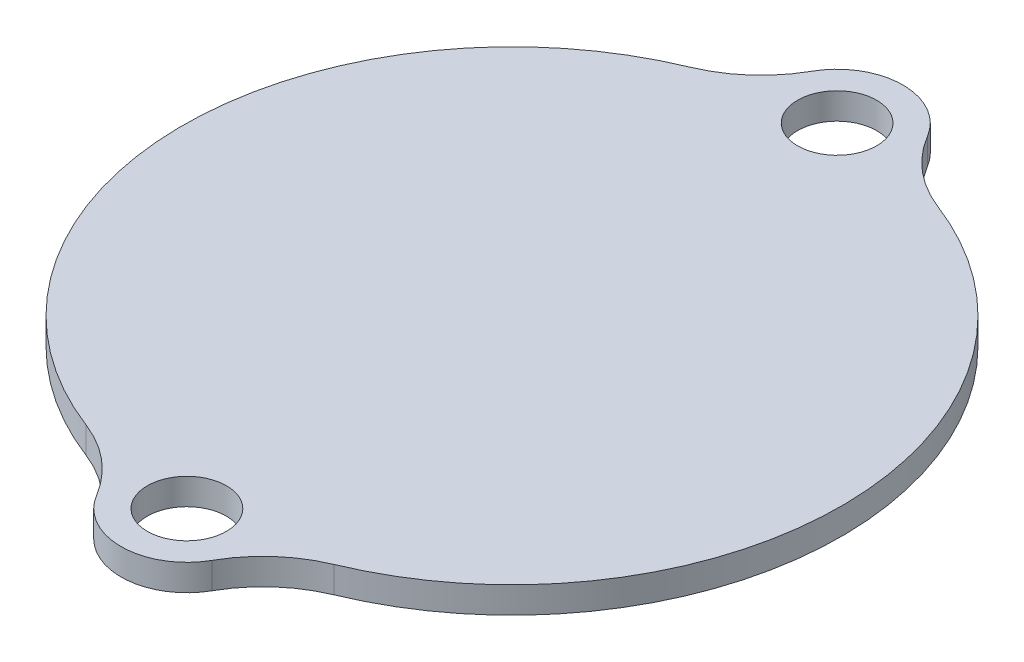
ISO-10303-21;
HEADER;
FILE_DESCRIPTION(('STEP AP214'),'2;1');
FILE_NAME('part.step','',(''),(''),'','','');
FILE_SCHEMA(('AUTOMOTIVE_DESIGN { 1 0 10303 214 1 1 1 1 }'));
ENDSEC;
DATA;
#1=APPLICATION_CONTEXT('core data for automotive mechanical design processes');
#2=APPLICATION_PROTOCOL_DEFINITION('international standard','automotive_design',2000,#1);
#3=PRODUCT_CONTEXT('',#1,'mechanical');
#4=PRODUCT('Part','Part','',(#3));
#5=PRODUCT_RELATED_PRODUCT_CATEGORY('part','',(#4));
#6=PRODUCT_DEFINITION_FORMATION('','',#4);
#7=PRODUCT_DEFINITION_CONTEXT('part definition',#1,'design');
#8=PRODUCT_DEFINITION('design','',#6,#7);
#9=PRODUCT_DEFINITION_SHAPE('','',#8);
#10=(LENGTH_UNIT() NAMED_UNIT(*) SI_UNIT(.MILLI.,.METRE.));
#11=(NAMED_UNIT(*) PLANE_ANGLE_UNIT() SI_UNIT($,.RADIAN.));
#12=(NAMED_UNIT(*) SI_UNIT($,.STERADIAN.) SOLID_ANGLE_UNIT());
#13=UNCERTAINTY_MEASURE_WITH_UNIT(LENGTH_MEASURE(1.E-05),#10,'distance_accuracy_value','');
#14=(GEOMETRIC_REPRESENTATION_CONTEXT(3) GLOBAL_UNCERTAINTY_ASSIGNED_CONTEXT((#13)) GLOBAL_UNIT_ASSIGNED_CONTEXT((#10,
#11,#12)) REPRESENTATION_CONTEXT('',''));
#15=CARTESIAN_POINT('',(0.,0.,0.));
#16=DIRECTION('',(0.,0.,1.));
#17=DIRECTION('',(1.,0.,0.));
#18=AXIS2_PLACEMENT_3D('',#15,#16,#17);
#19=CARTESIAN_POINT('',(-6.87723061472657,2.,-28.6610135737009));
#20=DIRECTION('',(0.,1.,0.));
#21=DIRECTION('',(0.,0.,1.));
#22=AXIS2_PLACEMENT_3D('',#19,#20,#21);
#23=PLANE('',#22);
#24=CARTESIAN_POINT('',(-0.332708957571853,2.,-24.9977859969548));
#25=DIRECTION('',(0.,1.,0.));
#26=DIRECTION('',(0.,0.,1.));
#27=AXIS2_PLACEMENT_3D('',#24,#25,#26);
#28=CIRCLE('',#27,3.);
#29=CARTESIAN_POINT('',(-0.332708957571853,2.,-21.9977859969548));
#30=VERTEX_POINT('',#29);
#31=EDGE_CURVE('E146',#30,#30,#28,.T.);
#32=ORIENTED_EDGE('',*,*,#31,.F.);
#33=EDGE_LOOP('',(#32));
#34=FACE_BOUND('',#33,.T.);
#35=CARTESIAN_POINT('',(-13.4217522718813,2.,-32.324241150447));
#36=DIRECTION('',(0.,-1.,0.));
#37=DIRECTION('',(0.,0.,1.));
#38=AXIS2_PLACEMENT_3D('',#35,#36,#37);
#39=CIRCLE('',#38,10.);
#40=CARTESIAN_POINT('',(-4.695723395675,2.,-27.4399377147855));
#41=VERTEX_POINT('',#40);
#42=CARTESIAN_POINT('',(-9.58696590848663,2.,-23.0887436788907));
#43=VERTEX_POINT('',#42);
#44=EDGE_CURVE('E164',#41,#43,#39,.T.);
#45=ORIENTED_EDGE('',*,*,#44,.T.);
#46=CARTESIAN_POINT('',(0.,2.,0.));
#47=DIRECTION('',(0.,1.,0.));
#48=DIRECTION('',(0.,0.,1.));
#49=AXIS2_PLACEMENT_3D('',#46,#47,#48);
#50=CIRCLE('',#49,25.);
#51=CARTESIAN_POINT('',(-8.96907784442479,2.,23.3357160297397));
#52=VERTEX_POINT('',#51);
#53=EDGE_CURVE('E100',#43,#52,#50,.T.);
#54=ORIENTED_EDGE('',*,*,#53,.T.);
#55=CARTESIAN_POINT('',(-12.5567089821947,2.,32.6700024416355));
#56=DIRECTION('',(0.,-1.,0.));
#57=DIRECTION('',(0.,0.,-1.));
#58=AXIS2_PLACEMENT_3D('',#55,#56,#57);
#59=CIRCLE('',#58,10.);
#60=CARTESIAN_POINT('',(-3.96376368901712,2.,27.5551914785151));
#61=VERTEX_POINT('',#60);
#62=EDGE_CURVE('E185',#52,#61,#59,.T.);
#63=ORIENTED_EDGE('',*,*,#62,.T.);
#64=CARTESIAN_POINT('',(0.332708957571678,2.,24.9977859969548));
#65=DIRECTION('',(0.,1.,0.));
#66=DIRECTION('',(0.,0.,1.));
#67=AXIS2_PLACEMENT_3D('',#64,#65,#66);
#68=CIRCLE('',#67,5.);
#69=CARTESIAN_POINT('',(4.69572339567481,2.,27.4399377147856));
#70=VERTEX_POINT('',#69);
#71=EDGE_CURVE('E199',#61,#70,#68,.T.);
#72=ORIENTED_EDGE('',*,*,#71,.T.);
#73=CARTESIAN_POINT('',(13.4217522718811,2.,32.3242411504471));
#74=DIRECTION('',(0.,-1.,0.));
#75=DIRECTION('',(0.,0.,1.));
#76=AXIS2_PLACEMENT_3D('',#73,#74,#75);
#77=CIRCLE('',#76,10.);
#78=CARTESIAN_POINT('',(9.58696590848648,2.,23.0887436788908));
#79=VERTEX_POINT('',#78);
#80=EDGE_CURVE('E119',#70,#79,#77,.T.);
#81=ORIENTED_EDGE('',*,*,#80,.T.);
#82=CARTESIAN_POINT('',(0.,2.,0.));
#83=DIRECTION('',(0.,1.,0.));
#84=DIRECTION('',(0.,0.,1.));
#85=AXIS2_PLACEMENT_3D('',#82,#83,#84);
#86=CIRCLE('',#85,25.);
#87=CARTESIAN_POINT('',(8.96907784442463,2.,-23.3357160297397));
#88=VERTEX_POINT('',#87);
#89=EDGE_CURVE('E113',#79,#88,#86,.T.);
#90=ORIENTED_EDGE('',*,*,#89,.T.);
#91=CARTESIAN_POINT('',(12.5567089821945,2.,-32.6700024416356));
#92=DIRECTION('',(0.,-1.,0.));
#93=DIRECTION('',(0.,0.,-1.));
#94=AXIS2_PLACEMENT_3D('',#91,#92,#93);
#95=CIRCLE('',#94,10.);
#96=CARTESIAN_POINT('',(3.96376368901692,2.,-27.5551914785151));
#97=VERTEX_POINT('',#96);
#98=EDGE_CURVE('E117',#88,#97,#95,.T.);
#99=ORIENTED_EDGE('',*,*,#98,.T.);
#100=CARTESIAN_POINT('',(-0.332708957571853,2.,-24.9977859969548));
#101=DIRECTION('',(0.,1.,0.));
#102=DIRECTION('',(0.,0.,1.));
#103=AXIS2_PLACEMENT_3D('',#100,#101,#102);
#104=CIRCLE('',#103,5.);
#105=EDGE_CURVE('E57',#97,#41,#104,.T.);
#106=ORIENTED_EDGE('',*,*,#105,.T.);
#107=EDGE_LOOP('',(#45,#54,#63,#72,#81,#90,#99,#106));
#108=FACE_BOUND('',#107,.T.);
#109=CARTESIAN_POINT('',(0.332708957571678,2.,24.9977859969548));
#110=DIRECTION('',(0.,1.,0.));
#111=DIRECTION('',(0.,0.,1.));
#112=AXIS2_PLACEMENT_3D('',#109,#110,#111);
#113=CIRCLE('',#112,3.);
#114=CARTESIAN_POINT('',(0.332708957571678,2.,27.9977859969548));
#115=VERTEX_POINT('',#114);
#116=EDGE_CURVE('E213',#115,#115,#113,.T.);
#117=ORIENTED_EDGE('',*,*,#116,.F.);
#118=EDGE_LOOP('',(#117));
#119=FACE_BOUND('',#118,.T.);
#120=ADVANCED_FACE('F39',(#34,#108,#119),#23,.T.);
#121=CARTESIAN_POINT('',(-6.87723061472657,0.,-28.6610135737009));
#122=DIRECTION('',(0.,1.,0.));
#123=DIRECTION('',(0.,0.,1.));
#124=AXIS2_PLACEMENT_3D('',#121,#122,#123);
#125=PLANE('',#124);
#126=CARTESIAN_POINT('',(-13.4217522718813,0.,-32.324241150447));
#127=DIRECTION('',(0.,-1.,0.));
#128=DIRECTION('',(0.,0.,1.));
#129=AXIS2_PLACEMENT_3D('',#126,#127,#128);
#130=CIRCLE('',#129,10.);
#131=CARTESIAN_POINT('',(-4.695723395675,0.,-27.4399377147855));
#132=VERTEX_POINT('',#131);
#133=CARTESIAN_POINT('',(-9.58696590848663,0.,-23.0887436788907));
#134=VERTEX_POINT('',#133);
#135=EDGE_CURVE('E141',#132,#134,#130,.T.);
#136=ORIENTED_EDGE('',*,*,#135,.F.);
#137=CARTESIAN_POINT('',(-0.332708957571853,0.,-24.9977859969548));
#138=DIRECTION('',(0.,1.,0.));
#139=DIRECTION('',(0.,0.,1.));
#140=AXIS2_PLACEMENT_3D('',#137,#138,#139);
#141=CIRCLE('',#140,5.);
#142=CARTESIAN_POINT('',(3.96376368901692,0.,-27.5551914785151));
#143=VERTEX_POINT('',#142);
#144=EDGE_CURVE('E92',#143,#132,#141,.T.);
#145=ORIENTED_EDGE('',*,*,#144,.F.);
#146=CARTESIAN_POINT('',(12.5567089821945,0.,-32.6700024416356));
#147=DIRECTION('',(0.,-1.,0.));
#148=DIRECTION('',(0.,0.,-1.));
#149=AXIS2_PLACEMENT_3D('',#146,#147,#148);
#150=CIRCLE('',#149,10.);
#151=CARTESIAN_POINT('',(8.96907784442463,0.,-23.3357160297397));
#152=VERTEX_POINT('',#151);
#153=EDGE_CURVE('E86',#152,#143,#150,.T.);
#154=ORIENTED_EDGE('',*,*,#153,.F.);
#155=CARTESIAN_POINT('',(0.,0.,0.));
#156=DIRECTION('',(0.,1.,0.));
#157=DIRECTION('',(0.,0.,1.));
#158=AXIS2_PLACEMENT_3D('',#155,#156,#157);
#159=CIRCLE('',#158,25.);
#160=CARTESIAN_POINT('',(9.58696590848648,0.,23.0887436788908));
#161=VERTEX_POINT('',#160);
#162=EDGE_CURVE('E128',#161,#152,#159,.T.);
#163=ORIENTED_EDGE('',*,*,#162,.F.);
#164=CARTESIAN_POINT('',(13.4217522718811,0.,32.3242411504471));
#165=DIRECTION('',(0.,-1.,0.));
#166=DIRECTION('',(0.,0.,1.));
#167=AXIS2_PLACEMENT_3D('',#164,#165,#166);
#168=CIRCLE('',#167,10.);
#169=CARTESIAN_POINT('',(4.69572339567481,0.,27.4399377147856));
#170=VERTEX_POINT('',#169);
#171=EDGE_CURVE('E155',#170,#161,#168,.T.);
#172=ORIENTED_EDGE('',*,*,#171,.F.);
#173=CARTESIAN_POINT('',(0.332708957571678,0.,24.9977859969548));
#174=DIRECTION('',(0.,1.,0.));
#175=DIRECTION('',(0.,0.,1.));
#176=AXIS2_PLACEMENT_3D('',#173,#174,#175);
#177=CIRCLE('',#176,5.);
#178=CARTESIAN_POINT('',(-3.96376368901712,0.,27.5551914785151));
#179=VERTEX_POINT('',#178);
#180=EDGE_CURVE('E152',#179,#170,#177,.T.);
#181=ORIENTED_EDGE('',*,*,#180,.F.);
#182=CARTESIAN_POINT('',(-12.5567089821947,0.,32.6700024416355));
#183=DIRECTION('',(0.,-1.,0.));
#184=DIRECTION('',(0.,0.,-1.));
#185=AXIS2_PLACEMENT_3D('',#182,#183,#184);
#186=CIRCLE('',#185,10.);
#187=CARTESIAN_POINT('',(-8.96907784442479,0.,23.3357160297397));
#188=VERTEX_POINT('',#187);
#189=EDGE_CURVE('E149',#188,#179,#186,.T.);
#190=ORIENTED_EDGE('',*,*,#189,.F.);
#191=CARTESIAN_POINT('',(0.,0.,0.));
#192=DIRECTION('',(0.,1.,0.));
#193=DIRECTION('',(0.,0.,1.));
#194=AXIS2_PLACEMENT_3D('',#191,#192,#193);
#195=CIRCLE('',#194,25.);
#196=EDGE_CURVE('E145',#134,#188,#195,.T.);
#197=ORIENTED_EDGE('',*,*,#196,.F.);
#198=EDGE_LOOP('',(#136,#145,#154,#163,#172,#181,#190,#197));
#199=FACE_BOUND('',#198,.T.);
#200=CARTESIAN_POINT('',(-0.332708957571853,0.,-24.9977859969548));
#201=DIRECTION('',(0.,1.,0.));
#202=DIRECTION('',(0.,0.,1.));
#203=AXIS2_PLACEMENT_3D('',#200,#201,#202);
#204=CIRCLE('',#203,3.);
#205=CARTESIAN_POINT('',(-0.332708957571853,0.,-21.9977859969548));
#206=VERTEX_POINT('',#205);
#207=EDGE_CURVE('E209',#206,#206,#204,.T.);
#208=ORIENTED_EDGE('',*,*,#207,.T.);
#209=EDGE_LOOP('',(#208));
#210=FACE_BOUND('',#209,.T.);
#211=CARTESIAN_POINT('',(0.332708957571678,0.,24.9977859969548));
#212=DIRECTION('',(0.,1.,0.));
#213=DIRECTION('',(0.,0.,1.));
#214=AXIS2_PLACEMENT_3D('',#211,#212,#213);
#215=CIRCLE('',#214,3.);
#216=CARTESIAN_POINT('',(0.332708957571678,0.,27.9977859969548));
#217=VERTEX_POINT('',#216);
#218=EDGE_CURVE('E217',#217,#217,#215,.T.);
#219=ORIENTED_EDGE('',*,*,#218,.T.);
#220=EDGE_LOOP('',(#219));
#221=FACE_BOUND('',#220,.T.);
#222=ADVANCED_FACE('F189',(#199,#210,#221),#125,.F.);
#223=CARTESIAN_POINT('',(-13.4217522718813,2.,-32.324241150447));
#224=DIRECTION('',(0.,-1.,0.));
#225=DIRECTION('',(0.,0.,-1.));
#226=AXIS2_PLACEMENT_3D('',#223,#224,#225);
#227=CYLINDRICAL_SURFACE('',#226,10.);
#228=ORIENTED_EDGE('',*,*,#135,.T.);
#229=DIRECTION('',(0.,-1.,0.));
#230=VECTOR('',#229,1.);
#231=CARTESIAN_POINT('',(-9.58696590848663,2.,-23.0887436788907));
#232=LINE('',#231,#230);
#233=EDGE_CURVE('E11',#43,#134,#232,.T.);
#234=ORIENTED_EDGE('',*,*,#233,.F.);
#235=ORIENTED_EDGE('',*,*,#44,.F.);
#236=DIRECTION('',(0.,-1.,0.));
#237=VECTOR('',#236,1.);
#238=CARTESIAN_POINT('',(-4.695723395675,2.,-27.4399377147855));
#239=LINE('',#238,#237);
#240=EDGE_CURVE('E137',#41,#132,#239,.T.);
#241=ORIENTED_EDGE('',*,*,#240,.T.);
#242=EDGE_LOOP('',(#228,#234,#235,#241));
#243=FACE_BOUND('',#242,.T.);
#244=ADVANCED_FACE('F41',(#243),#227,.F.);
#245=CARTESIAN_POINT('',(0.,2.,0.));
#246=DIRECTION('',(0.,-1.,0.));
#247=DIRECTION('',(0.,0.,-1.));
#248=AXIS2_PLACEMENT_3D('',#245,#246,#247);
#249=CYLINDRICAL_SURFACE('',#248,25.);
#250=ORIENTED_EDGE('',*,*,#196,.T.);
#251=DIRECTION('',(0.,-1.,0.));
#252=VECTOR('',#251,1.);
#253=CARTESIAN_POINT('',(-8.96907784442479,2.,23.3357160297397));
#254=LINE('',#253,#252);
#255=EDGE_CURVE('E49',#52,#188,#254,.T.);
#256=ORIENTED_EDGE('',*,*,#255,.F.);
#257=ORIENTED_EDGE('',*,*,#53,.F.);
#258=ORIENTED_EDGE('',*,*,#233,.T.);
#259=EDGE_LOOP('',(#250,#256,#257,#258));
#260=FACE_BOUND('',#259,.T.);
#261=ADVANCED_FACE('F251',(#260),#249,.T.);
#262=CARTESIAN_POINT('',(-12.5567089821947,2.,32.6700024416355));
#263=DIRECTION('',(0.,-1.,0.));
#264=DIRECTION('',(0.,0.,-1.));
#265=AXIS2_PLACEMENT_3D('',#262,#263,#264);
#266=CYLINDRICAL_SURFACE('',#265,10.);
#267=ORIENTED_EDGE('',*,*,#189,.T.);
#268=DIRECTION('',(0.,-1.,0.));
#269=VECTOR('',#268,1.);
#270=CARTESIAN_POINT('',(-3.96376368901712,2.,27.5551914785151));
#271=LINE('',#270,#269);
#272=EDGE_CURVE('E175',#61,#179,#271,.T.);
#273=ORIENTED_EDGE('',*,*,#272,.F.);
#274=ORIENTED_EDGE('',*,*,#62,.F.);
#275=ORIENTED_EDGE('',*,*,#255,.T.);
#276=EDGE_LOOP('',(#267,#273,#274,#275));
#277=FACE_BOUND('',#276,.T.);
#278=ADVANCED_FACE('F183',(#277),#266,.F.);
#279=CARTESIAN_POINT('',(0.332708957571678,2.,24.9977859969548));
#280=DIRECTION('',(0.,-1.,0.));
#281=DIRECTION('',(0.,0.,-1.));
#282=AXIS2_PLACEMENT_3D('',#279,#280,#281);
#283=CYLINDRICAL_SURFACE('',#282,5.);
#284=ORIENTED_EDGE('',*,*,#180,.T.);
#285=DIRECTION('',(0.,-1.,0.));
#286=VECTOR('',#285,1.);
#287=CARTESIAN_POINT('',(4.69572339567481,2.,27.4399377147856));
#288=LINE('',#287,#286);
#289=EDGE_CURVE('E171',#70,#170,#288,.T.);
#290=ORIENTED_EDGE('',*,*,#289,.F.);
#291=ORIENTED_EDGE('',*,*,#71,.F.);
#292=ORIENTED_EDGE('',*,*,#272,.T.);
#293=EDGE_LOOP('',(#284,#290,#291,#292));
#294=FACE_BOUND('',#293,.T.);
#295=ADVANCED_FACE('F194',(#294),#283,.T.);
#296=CARTESIAN_POINT('',(13.4217522718811,2.,32.3242411504471));
#297=DIRECTION('',(0.,-1.,0.));
#298=DIRECTION('',(0.,0.,-1.));
#299=AXIS2_PLACEMENT_3D('',#296,#297,#298);
#300=CYLINDRICAL_SURFACE('',#299,10.);
#301=ORIENTED_EDGE('',*,*,#171,.T.);
#302=DIRECTION('',(0.,-1.,0.));
#303=VECTOR('',#302,1.);
#304=CARTESIAN_POINT('',(9.58696590848648,2.,23.0887436788908));
#305=LINE('',#304,#303);
#306=EDGE_CURVE('E130',#79,#161,#305,.T.);
#307=ORIENTED_EDGE('',*,*,#306,.F.);
#308=ORIENTED_EDGE('',*,*,#80,.F.);
#309=ORIENTED_EDGE('',*,*,#289,.T.);
#310=EDGE_LOOP('',(#301,#307,#308,#309));
#311=FACE_BOUND('',#310,.T.);
#312=ADVANCED_FACE('F197',(#311),#300,.F.);
#313=CARTESIAN_POINT('',(0.,2.,0.));
#314=DIRECTION('',(0.,-1.,0.));
#315=DIRECTION('',(0.,0.,-1.));
#316=AXIS2_PLACEMENT_3D('',#313,#314,#315);
#317=CYLINDRICAL_SURFACE('',#316,25.);
#318=ORIENTED_EDGE('',*,*,#162,.T.);
#319=DIRECTION('',(0.,-1.,0.));
#320=VECTOR('',#319,1.);
#321=CARTESIAN_POINT('',(8.96907784442463,2.,-23.3357160297397));
#322=LINE('',#321,#320);
#323=EDGE_CURVE('E125',#88,#152,#322,.T.);
#324=ORIENTED_EDGE('',*,*,#323,.F.);
#325=ORIENTED_EDGE('',*,*,#89,.F.);
#326=ORIENTED_EDGE('',*,*,#306,.T.);
#327=EDGE_LOOP('',(#318,#324,#325,#326));
#328=FACE_BOUND('',#327,.T.);
#329=ADVANCED_FACE('F126',(#328),#317,.T.);
#330=CARTESIAN_POINT('',(12.5567089821945,2.,-32.6700024416356));
#331=DIRECTION('',(0.,-1.,0.));
#332=DIRECTION('',(0.,0.,-1.));
#333=AXIS2_PLACEMENT_3D('',#330,#331,#332);
#334=CYLINDRICAL_SURFACE('',#333,10.);
#335=ORIENTED_EDGE('',*,*,#153,.T.);
#336=DIRECTION('',(0.,-1.,0.));
#337=VECTOR('',#336,1.);
#338=CARTESIAN_POINT('',(3.96376368901692,2.,-27.5551914785151));
#339=LINE('',#338,#337);
#340=EDGE_CURVE('E131',#97,#143,#339,.T.);
#341=ORIENTED_EDGE('',*,*,#340,.F.);
#342=ORIENTED_EDGE('',*,*,#98,.F.);
#343=ORIENTED_EDGE('',*,*,#323,.T.);
#344=EDGE_LOOP('',(#335,#341,#342,#343));
#345=FACE_BOUND('',#344,.T.);
#346=ADVANCED_FACE('F133',(#345),#334,.F.);
#347=CARTESIAN_POINT('',(-0.332708957571853,2.,-24.9977859969548));
#348=DIRECTION('',(0.,-1.,0.));
#349=DIRECTION('',(0.,0.,-1.));
#350=AXIS2_PLACEMENT_3D('',#347,#348,#349);
#351=CYLINDRICAL_SURFACE('',#350,5.);
#352=ORIENTED_EDGE('',*,*,#144,.T.);
#353=ORIENTED_EDGE('',*,*,#240,.F.);
#354=ORIENTED_EDGE('',*,*,#105,.F.);
#355=ORIENTED_EDGE('',*,*,#340,.T.);
#356=EDGE_LOOP('',(#352,#353,#354,#355));
#357=FACE_BOUND('',#356,.T.);
#358=ADVANCED_FACE('F239',(#357),#351,.T.);
#359=CARTESIAN_POINT('',(-0.332708957571853,2.,-24.9977859969548));
#360=DIRECTION('',(0.,-1.,0.));
#361=DIRECTION('',(0.,0.,-1.));
#362=AXIS2_PLACEMENT_3D('',#359,#360,#361);
#363=CYLINDRICAL_SURFACE('',#362,3.);
#364=ORIENTED_EDGE('',*,*,#31,.T.);
#365=EDGE_LOOP('',(#364));
#366=FACE_BOUND('',#365,.T.);
#367=ORIENTED_EDGE('',*,*,#207,.F.);
#368=EDGE_LOOP('',(#367));
#369=FACE_BOUND('',#368,.T.);
#370=ADVANCED_FACE('F236',(#366,#369),#363,.F.);
#371=CARTESIAN_POINT('',(0.332708957571678,2.,24.9977859969548));
#372=DIRECTION('',(0.,-1.,0.));
#373=DIRECTION('',(0.,0.,-1.));
#374=AXIS2_PLACEMENT_3D('',#371,#372,#373);
#375=CYLINDRICAL_SURFACE('',#374,3.);
#376=ORIENTED_EDGE('',*,*,#116,.T.);
#377=EDGE_LOOP('',(#376));
#378=FACE_BOUND('',#377,.T.);
#379=ORIENTED_EDGE('',*,*,#218,.F.);
#380=EDGE_LOOP('',(#379));
#381=FACE_BOUND('',#380,.T.);
#382=ADVANCED_FACE('F225',(#378,#381),#375,.F.);
#383=CLOSED_SHELL('',(#120,#222,#244,#261,#278,#295,#312,#329,#346,#358,#370,#382));
#384=MANIFOLD_SOLID_BREP('B2',#383);
#385=ADVANCED_BREP_SHAPE_REPRESENTATION('',(#18,#384),#14);
#386=SHAPE_DEFINITION_REPRESENTATION(#9,#385);
ENDSEC;
END-ISO-10303-21;
